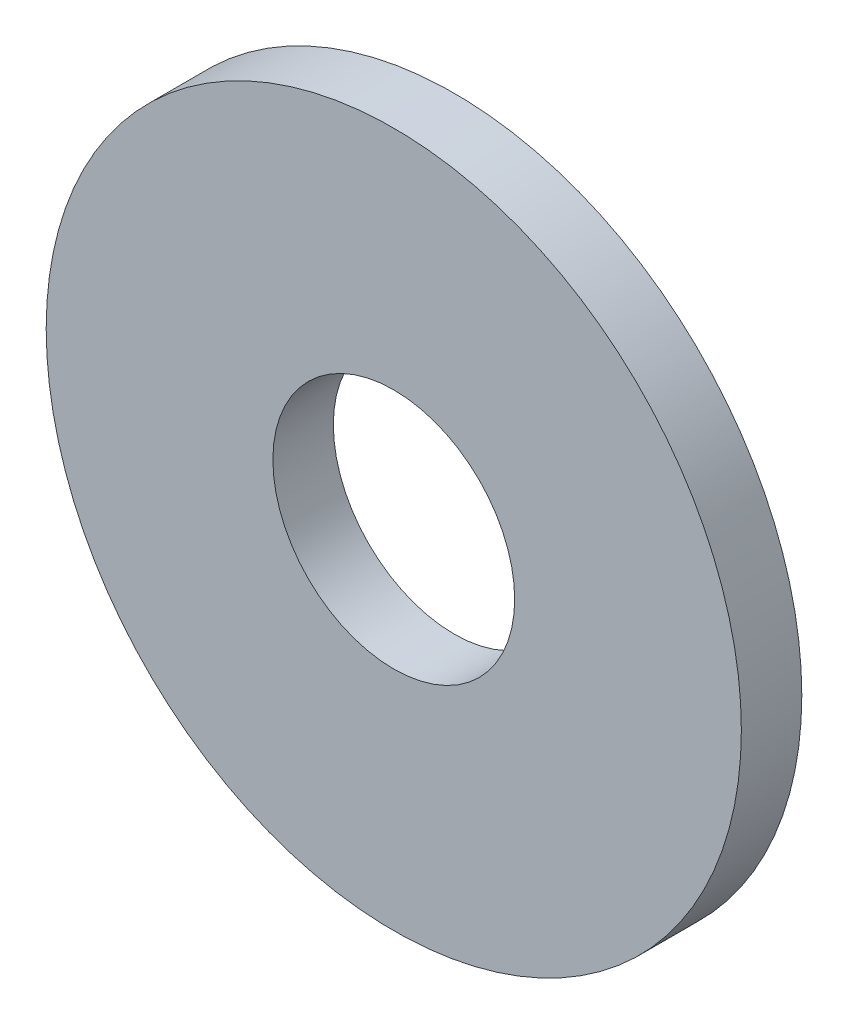
ISO-10303-21;
HEADER;
FILE_DESCRIPTION(('STEP AP214'),'2;1');
FILE_NAME('part.step','',(''),(''),'','','');
FILE_SCHEMA(('AUTOMOTIVE_DESIGN { 1 0 10303 214 1 1 1 1 }'));
ENDSEC;
DATA;
#1=APPLICATION_CONTEXT('core data for automotive mechanical design processes');
#2=APPLICATION_PROTOCOL_DEFINITION('international standard','automotive_design',2000,#1);
#3=PRODUCT_CONTEXT('',#1,'mechanical');
#4=PRODUCT('Part','Part','',(#3));
#5=PRODUCT_RELATED_PRODUCT_CATEGORY('part','',(#4));
#6=PRODUCT_DEFINITION_FORMATION('','',#4);
#7=PRODUCT_DEFINITION_CONTEXT('part definition',#1,'design');
#8=PRODUCT_DEFINITION('design','',#6,#7);
#9=PRODUCT_DEFINITION_SHAPE('','',#8);
#10=(LENGTH_UNIT() NAMED_UNIT(*) SI_UNIT(.MILLI.,.METRE.));
#11=(NAMED_UNIT(*) PLANE_ANGLE_UNIT() SI_UNIT($,.RADIAN.));
#12=(NAMED_UNIT(*) SI_UNIT($,.STERADIAN.) SOLID_ANGLE_UNIT());
#13=UNCERTAINTY_MEASURE_WITH_UNIT(LENGTH_MEASURE(1.E-05),#10,'distance_accuracy_value','');
#14=(GEOMETRIC_REPRESENTATION_CONTEXT(3) GLOBAL_UNCERTAINTY_ASSIGNED_CONTEXT((#13)) GLOBAL_UNIT_ASSIGNED_CONTEXT((#10,
#11,#12)) REPRESENTATION_CONTEXT('',''));
#15=CARTESIAN_POINT('',(0.,0.,0.));
#16=DIRECTION('',(0.,0.,1.));
#17=DIRECTION('',(1.,0.,0.));
#18=AXIS2_PLACEMENT_3D('',#15,#16,#17);
#19=CARTESIAN_POINT('',(0.,0.,2.));
#20=DIRECTION('',(0.,0.,1.));
#21=DIRECTION('',(1.,0.,0.));
#22=AXIS2_PLACEMENT_3D('',#19,#20,#21);
#23=PLANE('',#22);
#24=CARTESIAN_POINT('',(0.,0.,2.));
#25=DIRECTION('',(0.,0.,1.));
#26=DIRECTION('',(1.,0.,0.));
#27=AXIS2_PLACEMENT_3D('',#24,#25,#26);
#28=CIRCLE('',#27,11.5);
#29=CARTESIAN_POINT('',(11.5,0.,2.));
#30=VERTEX_POINT('',#29);
#31=EDGE_CURVE('E10',#30,#30,#28,.T.);
#32=ORIENTED_EDGE('',*,*,#31,.T.);
#33=EDGE_LOOP('',(#32));
#34=FACE_BOUND('',#33,.T.);
#35=CARTESIAN_POINT('',(0.,0.,2.));
#36=DIRECTION('',(0.,0.,1.));
#37=DIRECTION('',(1.,0.,0.));
#38=AXIS2_PLACEMENT_3D('',#35,#36,#37);
#39=CIRCLE('',#38,4.);
#40=CARTESIAN_POINT('',(4.,0.,2.));
#41=VERTEX_POINT('',#40);
#42=EDGE_CURVE('E42',#41,#41,#39,.T.);
#43=ORIENTED_EDGE('',*,*,#42,.F.);
#44=EDGE_LOOP('',(#43));
#45=FACE_BOUND('',#44,.T.);
#46=ADVANCED_FACE('F31',(#34,#45),#23,.T.);
#47=CARTESIAN_POINT('',(0.,0.,0.));
#48=DIRECTION('',(0.,0.,1.));
#49=DIRECTION('',(1.,0.,0.));
#50=AXIS2_PLACEMENT_3D('',#47,#48,#49);
#51=PLANE('',#50);
#52=CARTESIAN_POINT('',(0.,0.,0.));
#53=DIRECTION('',(0.,0.,1.));
#54=DIRECTION('',(1.,0.,0.));
#55=AXIS2_PLACEMENT_3D('',#52,#53,#54);
#56=CIRCLE('',#55,11.5);
#57=CARTESIAN_POINT('',(11.5,0.,0.));
#58=VERTEX_POINT('',#57);
#59=EDGE_CURVE('E35',#58,#58,#56,.T.);
#60=ORIENTED_EDGE('',*,*,#59,.F.);
#61=EDGE_LOOP('',(#60));
#62=FACE_BOUND('',#61,.T.);
#63=CARTESIAN_POINT('',(0.,0.,0.));
#64=DIRECTION('',(0.,0.,1.));
#65=DIRECTION('',(1.,0.,0.));
#66=AXIS2_PLACEMENT_3D('',#63,#64,#65);
#67=CIRCLE('',#66,4.);
#68=CARTESIAN_POINT('',(4.,0.,0.));
#69=VERTEX_POINT('',#68);
#70=EDGE_CURVE('E44',#69,#69,#67,.T.);
#71=ORIENTED_EDGE('',*,*,#70,.T.);
#72=EDGE_LOOP('',(#71));
#73=FACE_BOUND('',#72,.T.);
#74=ADVANCED_FACE('F54',(#62,#73),#51,.F.);
#75=CARTESIAN_POINT('',(0.,0.,2.));
#76=DIRECTION('',(0.,0.,-1.));
#77=DIRECTION('',(-1.,0.,0.));
#78=AXIS2_PLACEMENT_3D('',#75,#76,#77);
#79=CYLINDRICAL_SURFACE('',#78,11.5);
#80=ORIENTED_EDGE('',*,*,#31,.F.);
#81=EDGE_LOOP('',(#80));
#82=FACE_BOUND('',#81,.T.);
#83=ORIENTED_EDGE('',*,*,#59,.T.);
#84=EDGE_LOOP('',(#83));
#85=FACE_BOUND('',#84,.T.);
#86=ADVANCED_FACE('F33',(#82,#85),#79,.T.);
#87=CARTESIAN_POINT('',(0.,0.,2.));
#88=DIRECTION('',(0.,0.,-1.));
#89=DIRECTION('',(-1.,0.,0.));
#90=AXIS2_PLACEMENT_3D('',#87,#88,#89);
#91=CYLINDRICAL_SURFACE('',#90,4.);
#92=ORIENTED_EDGE('',*,*,#42,.T.);
#93=EDGE_LOOP('',(#92));
#94=FACE_BOUND('',#93,.T.);
#95=ORIENTED_EDGE('',*,*,#70,.F.);
#96=EDGE_LOOP('',(#95));
#97=FACE_BOUND('',#96,.T.);
#98=ADVANCED_FACE('F50',(#94,#97),#91,.F.);
#99=CLOSED_SHELL('',(#46,#74,#86,#98));
#100=MANIFOLD_SOLID_BREP('B2',#99);
#101=ADVANCED_BREP_SHAPE_REPRESENTATION('',(#18,#100),#14);
#102=SHAPE_DEFINITION_REPRESENTATION(#9,#101);
ENDSEC;
END-ISO-10303-21;
